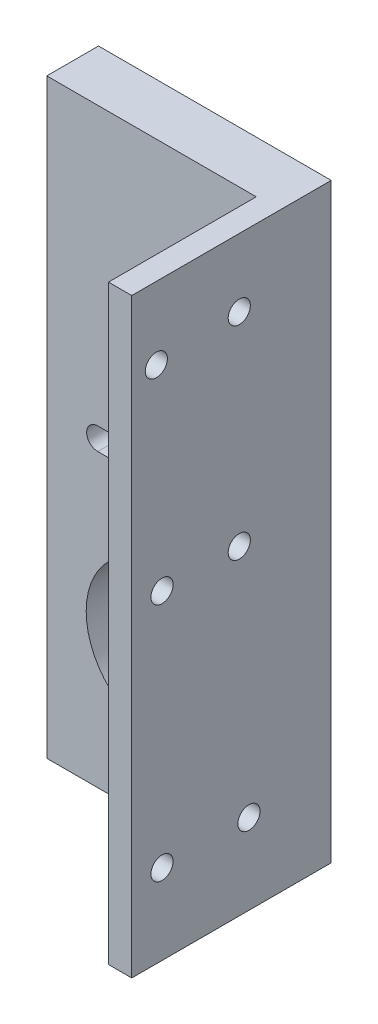
ISO-10303-21;
HEADER;
FILE_DESCRIPTION(('STEP AP214'),'2;1');
FILE_NAME('part.step','',(''),(''),'','','');
FILE_SCHEMA(('AUTOMOTIVE_DESIGN { 1 0 10303 214 1 1 1 1 }'));
ENDSEC;
DATA;
#1=APPLICATION_CONTEXT('core data for automotive mechanical design processes');
#2=APPLICATION_PROTOCOL_DEFINITION('international standard','automotive_design',2000,#1);
#3=PRODUCT_CONTEXT('',#1,'mechanical');
#4=PRODUCT('Part','Part','',(#3));
#5=PRODUCT_RELATED_PRODUCT_CATEGORY('part','',(#4));
#6=PRODUCT_DEFINITION_FORMATION('','',#4);
#7=PRODUCT_DEFINITION_CONTEXT('part definition',#1,'design');
#8=PRODUCT_DEFINITION('design','',#6,#7);
#9=PRODUCT_DEFINITION_SHAPE('','',#8);
#10=(LENGTH_UNIT() NAMED_UNIT(*) SI_UNIT(.MILLI.,.METRE.));
#11=(NAMED_UNIT(*) PLANE_ANGLE_UNIT() SI_UNIT($,.RADIAN.));
#12=(NAMED_UNIT(*) SI_UNIT($,.STERADIAN.) SOLID_ANGLE_UNIT());
#13=UNCERTAINTY_MEASURE_WITH_UNIT(LENGTH_MEASURE(1.E-05),#10,'distance_accuracy_value','');
#14=(GEOMETRIC_REPRESENTATION_CONTEXT(3) GLOBAL_UNCERTAINTY_ASSIGNED_CONTEXT((#13)) GLOBAL_UNIT_ASSIGNED_CONTEXT((#10,
#11,#12)) REPRESENTATION_CONTEXT('',''));
#15=CARTESIAN_POINT('',(0.,0.,0.));
#16=DIRECTION('',(0.,0.,1.));
#17=DIRECTION('',(1.,0.,0.));
#18=AXIS2_PLACEMENT_3D('',#15,#16,#17);
#19=CARTESIAN_POINT('',(12.602682203763,53.3770786942291,27.));
#20=DIRECTION('',(1.,0.,0.));
#21=DIRECTION('',(0.,0.,-1.));
#22=AXIS2_PLACEMENT_3D('',#19,#20,#21);
#23=PLANE('',#22);
#24=CARTESIAN_POINT('',(12.602682203763,43.5784982496159,23.673777790588));
#25=DIRECTION('',(-1.,0.,0.));
#26=DIRECTION('',(0.,0.,1.));
#27=AXIS2_PLACEMENT_3D('',#24,#25,#26);
#28=CIRCLE('',#27,1.49999999999999);
#29=CARTESIAN_POINT('',(12.602682203763,43.5784982496159,25.173777790588));
#30=VERTEX_POINT('',#29);
#31=EDGE_CURVE('E333',#30,#30,#28,.T.);
#32=ORIENTED_EDGE('',*,*,#31,.F.);
#33=EDGE_LOOP('',(#32));
#34=FACE_BOUND('',#33,.T.);
#35=CARTESIAN_POINT('',(12.602682203763,16.7045137847595,12.4447941729091));
#36=DIRECTION('',(-1.,0.,0.));
#37=DIRECTION('',(0.,0.,1.));
#38=AXIS2_PLACEMENT_3D('',#35,#36,#37);
#39=CIRCLE('',#38,1.49999999999999);
#40=CARTESIAN_POINT('',(12.602682203763,16.7045137847595,13.9447941729091));
#41=VERTEX_POINT('',#40);
#42=EDGE_CURVE('E309',#41,#41,#39,.T.);
#43=ORIENTED_EDGE('',*,*,#42,.F.);
#44=EDGE_LOOP('',(#43));
#45=FACE_BOUND('',#44,.T.);
#46=CARTESIAN_POINT('',(12.602682203763,16.7045137847595,22.9001078619948));
#47=DIRECTION('',(-1.,0.,0.));
#48=DIRECTION('',(0.,0.,1.));
#49=AXIS2_PLACEMENT_3D('',#46,#47,#48);
#50=CIRCLE('',#49,1.49999999999999);
#51=CARTESIAN_POINT('',(12.602682203763,16.7045137847595,24.4001078619948));
#52=VERTEX_POINT('',#51);
#53=EDGE_CURVE('E301',#52,#52,#50,.T.);
#54=ORIENTED_EDGE('',*,*,#53,.F.);
#55=EDGE_LOOP('',(#54));
#56=FACE_BOUND('',#55,.T.);
#57=DIRECTION('',(0.,1.,0.));
#58=VECTOR('',#57,1.);
#59=CARTESIAN_POINT('',(12.602682203763,0.,7.));
#60=LINE('',#59,#58);
#61=CARTESIAN_POINT('',(12.602682203763,-26.6229213057709,7.));
#62=VERTEX_POINT('',#61);
#63=CARTESIAN_POINT('',(12.602682203763,53.3770786942291,7.));
#64=VERTEX_POINT('',#63);
#65=EDGE_CURVE('E164',#62,#64,#60,.T.);
#66=ORIENTED_EDGE('',*,*,#65,.F.);
#67=DIRECTION('',(0.,0.,-1.));
#68=VECTOR('',#67,1.);
#69=CARTESIAN_POINT('',(12.602682203763,-26.6229213057709,27.));
#70=LINE('',#69,#68);
#71=CARTESIAN_POINT('',(12.602682203763,-26.6229213057709,27.));
#72=VERTEX_POINT('',#71);
#73=EDGE_CURVE('E59',#72,#62,#70,.T.);
#74=ORIENTED_EDGE('',*,*,#73,.F.);
#75=DIRECTION('',(0.,-1.,0.));
#76=VECTOR('',#75,1.);
#77=CARTESIAN_POINT('',(12.602682203763,53.3770786942291,27.));
#78=LINE('',#77,#76);
#79=CARTESIAN_POINT('',(12.602682203763,53.3770786942291,27.));
#80=VERTEX_POINT('',#79);
#81=EDGE_CURVE('E285',#80,#72,#78,.T.);
#82=ORIENTED_EDGE('',*,*,#81,.F.);
#83=DIRECTION('',(0.,0.,-1.));
#84=VECTOR('',#83,1.);
#85=CARTESIAN_POINT('',(12.602682203763,53.3770786942291,27.));
#86=LINE('',#85,#84);
#87=EDGE_CURVE('E275',#80,#64,#86,.T.);
#88=ORIENTED_EDGE('',*,*,#87,.T.);
#89=EDGE_LOOP('',(#66,#74,#82,#88));
#90=FACE_BOUND('',#89,.T.);
#91=CARTESIAN_POINT('',(12.602682203763,-15.739218974403,22.9001078619948));
#92=DIRECTION('',(-1.,0.,0.));
#93=DIRECTION('',(0.,0.,1.));
#94=AXIS2_PLACEMENT_3D('',#91,#92,#93);
#95=CIRCLE('',#94,1.49999999999999);
#96=CARTESIAN_POINT('',(12.602682203763,-15.739218974403,24.4001078619948));
#97=VERTEX_POINT('',#96);
#98=EDGE_CURVE('E317',#97,#97,#95,.T.);
#99=ORIENTED_EDGE('',*,*,#98,.F.);
#100=EDGE_LOOP('',(#99));
#101=FACE_BOUND('',#100,.T.);
#102=CARTESIAN_POINT('',(12.602682203763,-15.739218974403,11.1300727882533));
#103=DIRECTION('',(-1.,0.,0.));
#104=DIRECTION('',(0.,0.,1.));
#105=AXIS2_PLACEMENT_3D('',#102,#103,#104);
#106=CIRCLE('',#105,1.49999999999999);
#107=CARTESIAN_POINT('',(12.602682203763,-15.739218974403,12.6300727882533));
#108=VERTEX_POINT('',#107);
#109=EDGE_CURVE('E325',#108,#108,#106,.T.);
#110=ORIENTED_EDGE('',*,*,#109,.F.);
#111=EDGE_LOOP('',(#110));
#112=FACE_BOUND('',#111,.T.);
#113=CARTESIAN_POINT('',(12.602682203763,44.1925404225003,12.4447941729091));
#114=DIRECTION('',(-1.,0.,0.));
#115=DIRECTION('',(0.,0.,1.));
#116=AXIS2_PLACEMENT_3D('',#113,#114,#115);
#117=CIRCLE('',#116,1.49999999999999);
#118=CARTESIAN_POINT('',(12.602682203763,44.1925404225003,13.9447941729091));
#119=VERTEX_POINT('',#118);
#120=EDGE_CURVE('E341',#119,#119,#117,.T.);
#121=ORIENTED_EDGE('',*,*,#120,.F.);
#122=EDGE_LOOP('',(#121));
#123=FACE_BOUND('',#122,.T.);
#124=ADVANCED_FACE('F41',(#34,#45,#56,#90,#101,#112,#123),#23,.F.);
#125=CARTESIAN_POINT('',(0.,0.,7.));
#126=DIRECTION('',(0.,0.,1.));
#127=DIRECTION('',(1.,0.,0.));
#128=AXIS2_PLACEMENT_3D('',#125,#126,#127);
#129=PLANE('',#128);
#130=CARTESIAN_POINT('',(-2.70616862252382E-13,-20.2083333333333,7.));
#131=DIRECTION('',(0.,0.,1.));
#132=DIRECTION('',(1.,0.,0.));
#133=AXIS2_PLACEMENT_3D('',#130,#131,#132);
#134=CIRCLE('',#133,1.56);
#135=CARTESIAN_POINT('',(1.55999999999973,-20.2083333333333,7.));
#136=VERTEX_POINT('',#135);
#137=EDGE_CURVE('E135',#136,#136,#134,.T.);
#138=ORIENTED_EDGE('',*,*,#137,.F.);
#139=EDGE_LOOP('',(#138));
#140=FACE_BOUND('',#139,.T.);
#141=CARTESIAN_POINT('',(8.85,14.2916666666667,7.));
#142=DIRECTION('',(0.,0.,1.));
#143=DIRECTION('',(1.,0.,0.));
#144=AXIS2_PLACEMENT_3D('',#141,#142,#143);
#145=CIRCLE('',#144,1.5);
#146=CARTESIAN_POINT('',(8.85,12.7916666666667,7.));
#147=VERTEX_POINT('',#146);
#148=CARTESIAN_POINT('',(8.85,15.7916666666667,7.));
#149=VERTEX_POINT('',#148);
#150=EDGE_CURVE('E130',#147,#149,#145,.T.);
#151=ORIENTED_EDGE('',*,*,#150,.F.);
#152=DIRECTION('',(-1.,0.,0.));
#153=VECTOR('',#152,1.);
#154=CARTESIAN_POINT('',(0.,12.7916666666667,7.));
#155=LINE('',#154,#153);
#156=CARTESIAN_POINT('',(-8.85,12.7916666666667,7.));
#157=VERTEX_POINT('',#156);
#158=EDGE_CURVE('E134',#147,#157,#155,.T.);
#159=ORIENTED_EDGE('',*,*,#158,.T.);
#160=CARTESIAN_POINT('',(-8.85,14.2916666666667,7.));
#161=DIRECTION('',(0.,0.,1.));
#162=DIRECTION('',(1.,0.,0.));
#163=AXIS2_PLACEMENT_3D('',#160,#161,#162);
#164=CIRCLE('',#163,1.5);
#165=CARTESIAN_POINT('',(-8.85,15.7916666666667,7.));
#166=VERTEX_POINT('',#165);
#167=EDGE_CURVE('E141',#166,#157,#164,.T.);
#168=ORIENTED_EDGE('',*,*,#167,.F.);
#169=DIRECTION('',(-1.,0.,0.));
#170=VECTOR('',#169,1.);
#171=CARTESIAN_POINT('',(0.,15.7916666666667,7.));
#172=LINE('',#171,#170);
#173=EDGE_CURVE('E121',#149,#166,#172,.T.);
#174=ORIENTED_EDGE('',*,*,#173,.F.);
#175=EDGE_LOOP('',(#151,#159,#168,#174));
#176=FACE_BOUND('',#175,.T.);
#177=CARTESIAN_POINT('',(0.,-6.70833333333333,7.));
#178=DIRECTION('',(0.,0.,1.));
#179=DIRECTION('',(1.,0.,0.));
#180=AXIS2_PLACEMENT_3D('',#177,#178,#179);
#181=CIRCLE('',#180,10.4175243347668);
#182=CARTESIAN_POINT('',(10.4175243347668,-6.70833333333333,7.));
#183=VERTEX_POINT('',#182);
#184=EDGE_CURVE('E143',#183,#183,#181,.T.);
#185=ORIENTED_EDGE('',*,*,#184,.F.);
#186=EDGE_LOOP('',(#185));
#187=FACE_BOUND('',#186,.T.);
#188=DIRECTION('',(-1.,0.,0.));
#189=VECTOR('',#188,1.);
#190=CARTESIAN_POINT('',(0.,-26.6229213057709,7.));
#191=LINE('',#190,#189);
#192=CARTESIAN_POINT('',(-15.7504319540044,-26.6229213057709,7.));
#193=VERTEX_POINT('',#192);
#194=EDGE_CURVE('E65',#62,#193,#191,.T.);
#195=ORIENTED_EDGE('',*,*,#194,.F.);
#196=ORIENTED_EDGE('',*,*,#65,.T.);
#197=DIRECTION('',(-1.,0.,0.));
#198=VECTOR('',#197,1.);
#199=CARTESIAN_POINT('',(0.,53.3770786942291,7.));
#200=LINE('',#199,#198);
#201=CARTESIAN_POINT('',(-15.7504319540044,53.3770786942291,7.));
#202=VERTEX_POINT('',#201);
#203=EDGE_CURVE('E154',#64,#202,#200,.T.);
#204=ORIENTED_EDGE('',*,*,#203,.T.);
#205=DIRECTION('',(0.,-1.,0.));
#206=VECTOR('',#205,1.);
#207=CARTESIAN_POINT('',(-15.7504319540044,0.,7.));
#208=LINE('',#207,#206);
#209=EDGE_CURVE('E127',#202,#193,#208,.T.);
#210=ORIENTED_EDGE('',*,*,#209,.T.);
#211=EDGE_LOOP('',(#195,#196,#204,#210));
#212=FACE_BOUND('',#211,.T.);
#213=ADVANCED_FACE('F138',(#140,#176,#187,#212),#129,.T.);
#214=CARTESIAN_POINT('',(0.,-26.6229213057709,7.));
#215=DIRECTION('',(0.,-1.,0.));
#216=DIRECTION('',(0.,0.,-1.));
#217=AXIS2_PLACEMENT_3D('',#214,#215,#216);
#218=PLANE('',#217);
#219=ORIENTED_EDGE('',*,*,#73,.T.);
#220=ORIENTED_EDGE('',*,*,#194,.T.);
#221=DIRECTION('',(0.,0.,-1.));
#222=VECTOR('',#221,1.);
#223=CARTESIAN_POINT('',(-15.7504319540044,-26.6229213057709,7.));
#224=LINE('',#223,#222);
#225=CARTESIAN_POINT('',(-15.7504319540044,-26.6229213057709,0.));
#226=VERTEX_POINT('',#225);
#227=EDGE_CURVE('E193',#193,#226,#224,.T.);
#228=ORIENTED_EDGE('',*,*,#227,.T.);
#229=DIRECTION('',(-1.,0.,0.));
#230=VECTOR('',#229,1.);
#231=CARTESIAN_POINT('',(0.,-26.6229213057709,0.));
#232=LINE('',#231,#230);
#233=CARTESIAN_POINT('',(15.7504319540038,-26.6229213057709,0.));
#234=VERTEX_POINT('',#233);
#235=EDGE_CURVE('E99',#234,#226,#232,.T.);
#236=ORIENTED_EDGE('',*,*,#235,.F.);
#237=DIRECTION('',(0.,0.,-1.));
#238=VECTOR('',#237,1.);
#239=CARTESIAN_POINT('',(15.7504319540038,-26.6229213057709,7.));
#240=LINE('',#239,#238);
#241=CARTESIAN_POINT('',(15.7504319540038,-26.6229213057709,27.));
#242=VERTEX_POINT('',#241);
#243=EDGE_CURVE('E11',#242,#234,#240,.T.);
#244=ORIENTED_EDGE('',*,*,#243,.F.);
#245=DIRECTION('',(1.,0.,0.));
#246=VECTOR('',#245,1.);
#247=CARTESIAN_POINT('',(12.602682203763,-26.6229213057709,27.));
#248=LINE('',#247,#246);
#249=EDGE_CURVE('E281',#72,#242,#248,.T.);
#250=ORIENTED_EDGE('',*,*,#249,.F.);
#251=EDGE_LOOP('',(#219,#220,#228,#236,#244,#250));
#252=FACE_BOUND('',#251,.T.);
#253=ADVANCED_FACE('F233',(#252),#218,.T.);
#254=CARTESIAN_POINT('',(15.7504319540038,0.,7.));
#255=DIRECTION('',(1.,0.,0.));
#256=DIRECTION('',(0.,1.,0.));
#257=AXIS2_PLACEMENT_3D('',#254,#255,#256);
#258=PLANE('',#257);
#259=CARTESIAN_POINT('',(15.7504319540038,44.1925404225003,12.4447941729091));
#260=DIRECTION('',(1.,0.,0.));
#261=DIRECTION('',(0.,1.,0.));
#262=AXIS2_PLACEMENT_3D('',#259,#260,#261);
#263=CIRCLE('',#262,1.49999999999999);
#264=CARTESIAN_POINT('',(15.7504319540038,45.6925404225003,12.4447941729091));
#265=VERTEX_POINT('',#264);
#266=EDGE_CURVE('E337',#265,#265,#263,.T.);
#267=ORIENTED_EDGE('',*,*,#266,.F.);
#268=EDGE_LOOP('',(#267));
#269=FACE_BOUND('',#268,.T.);
#270=CARTESIAN_POINT('',(15.7504319540038,43.5784982496159,23.673777790588));
#271=DIRECTION('',(1.,0.,0.));
#272=DIRECTION('',(0.,1.,0.));
#273=AXIS2_PLACEMENT_3D('',#270,#271,#272);
#274=CIRCLE('',#273,1.49999999999999);
#275=CARTESIAN_POINT('',(15.7504319540038,45.0784982496159,23.673777790588));
#276=VERTEX_POINT('',#275);
#277=EDGE_CURVE('E329',#276,#276,#274,.T.);
#278=ORIENTED_EDGE('',*,*,#277,.F.);
#279=EDGE_LOOP('',(#278));
#280=FACE_BOUND('',#279,.T.);
#281=CARTESIAN_POINT('',(15.7504319540038,-15.739218974403,11.1300727882533));
#282=DIRECTION('',(1.,0.,0.));
#283=DIRECTION('',(0.,1.,0.));
#284=AXIS2_PLACEMENT_3D('',#281,#282,#283);
#285=CIRCLE('',#284,1.49999999999999);
#286=CARTESIAN_POINT('',(15.7504319540038,-14.239218974403,11.1300727882533));
#287=VERTEX_POINT('',#286);
#288=EDGE_CURVE('E321',#287,#287,#285,.T.);
#289=ORIENTED_EDGE('',*,*,#288,.F.);
#290=EDGE_LOOP('',(#289));
#291=FACE_BOUND('',#290,.T.);
#292=CARTESIAN_POINT('',(15.7504319540038,-15.739218974403,22.9001078619948));
#293=DIRECTION('',(1.,0.,0.));
#294=DIRECTION('',(0.,1.,0.));
#295=AXIS2_PLACEMENT_3D('',#292,#293,#294);
#296=CIRCLE('',#295,1.49999999999999);
#297=CARTESIAN_POINT('',(15.7504319540038,-14.239218974403,22.9001078619948));
#298=VERTEX_POINT('',#297);
#299=EDGE_CURVE('E313',#298,#298,#296,.T.);
#300=ORIENTED_EDGE('',*,*,#299,.F.);
#301=EDGE_LOOP('',(#300));
#302=FACE_BOUND('',#301,.T.);
#303=CARTESIAN_POINT('',(15.7504319540038,16.7045137847595,12.4447941729091));
#304=DIRECTION('',(1.,0.,0.));
#305=DIRECTION('',(0.,1.,0.));
#306=AXIS2_PLACEMENT_3D('',#303,#304,#305);
#307=CIRCLE('',#306,1.49999999999999);
#308=CARTESIAN_POINT('',(15.7504319540038,18.2045137847594,12.4447941729091));
#309=VERTEX_POINT('',#308);
#310=EDGE_CURVE('E305',#309,#309,#307,.T.);
#311=ORIENTED_EDGE('',*,*,#310,.F.);
#312=EDGE_LOOP('',(#311));
#313=FACE_BOUND('',#312,.T.);
#314=CARTESIAN_POINT('',(15.7504319540038,16.7045137847595,22.9001078619948));
#315=DIRECTION('',(1.,0.,0.));
#316=DIRECTION('',(0.,1.,0.));
#317=AXIS2_PLACEMENT_3D('',#314,#315,#316);
#318=CIRCLE('',#317,1.49999999999999);
#319=CARTESIAN_POINT('',(15.7504319540038,18.2045137847594,22.9001078619948));
#320=VERTEX_POINT('',#319);
#321=EDGE_CURVE('E297',#320,#320,#318,.T.);
#322=ORIENTED_EDGE('',*,*,#321,.F.);
#323=EDGE_LOOP('',(#322));
#324=FACE_BOUND('',#323,.T.);
#325=DIRECTION('',(0.,-1.,0.));
#326=VECTOR('',#325,1.);
#327=CARTESIAN_POINT('',(15.7504319540038,0.,0.));
#328=LINE('',#327,#326);
#329=CARTESIAN_POINT('',(15.7504319540038,53.3770786942291,0.));
#330=VERTEX_POINT('',#329);
#331=EDGE_CURVE('E183',#330,#234,#328,.T.);
#332=ORIENTED_EDGE('',*,*,#331,.F.);
#333=DIRECTION('',(0.,0.,-1.));
#334=VECTOR('',#333,1.);
#335=CARTESIAN_POINT('',(15.7504319540038,53.3770786942291,7.));
#336=LINE('',#335,#334);
#337=CARTESIAN_POINT('',(15.7504319540038,53.3770786942291,27.));
#338=VERTEX_POINT('',#337);
#339=EDGE_CURVE('E51',#338,#330,#336,.T.);
#340=ORIENTED_EDGE('',*,*,#339,.F.);
#341=DIRECTION('',(0.,1.,0.));
#342=VECTOR('',#341,1.);
#343=CARTESIAN_POINT('',(15.7504319540038,-26.6229213057709,27.));
#344=LINE('',#343,#342);
#345=EDGE_CURVE('E293',#242,#338,#344,.T.);
#346=ORIENTED_EDGE('',*,*,#345,.F.);
#347=ORIENTED_EDGE('',*,*,#243,.T.);
#348=EDGE_LOOP('',(#332,#340,#346,#347));
#349=FACE_BOUND('',#348,.T.);
#350=ADVANCED_FACE('F251',(#269,#280,#291,#302,#313,#324,#349),#258,.T.);
#351=CARTESIAN_POINT('',(0.,53.3770786942291,7.));
#352=DIRECTION('',(0.,-1.,0.));
#353=DIRECTION('',(1.,0.,0.));
#354=AXIS2_PLACEMENT_3D('',#351,#352,#353);
#355=PLANE('',#354);
#356=DIRECTION('',(-1.,0.,0.));
#357=VECTOR('',#356,1.);
#358=CARTESIAN_POINT('',(0.,53.3770786942291,0.));
#359=LINE('',#358,#357);
#360=CARTESIAN_POINT('',(-15.7504319540044,53.3770786942291,0.));
#361=VERTEX_POINT('',#360);
#362=EDGE_CURVE('E186',#330,#361,#359,.T.);
#363=ORIENTED_EDGE('',*,*,#362,.T.);
#364=DIRECTION('',(0.,0.,-1.));
#365=VECTOR('',#364,1.);
#366=CARTESIAN_POINT('',(-15.7504319540044,53.3770786942291,7.));
#367=LINE('',#366,#365);
#368=EDGE_CURVE('E196',#202,#361,#367,.T.);
#369=ORIENTED_EDGE('',*,*,#368,.F.);
#370=ORIENTED_EDGE('',*,*,#203,.F.);
#371=ORIENTED_EDGE('',*,*,#87,.F.);
#372=DIRECTION('',(-1.,0.,0.));
#373=VECTOR('',#372,1.);
#374=CARTESIAN_POINT('',(15.7504319540038,53.3770786942291,27.));
#375=LINE('',#374,#373);
#376=EDGE_CURVE('E289',#338,#80,#375,.T.);
#377=ORIENTED_EDGE('',*,*,#376,.F.);
#378=ORIENTED_EDGE('',*,*,#339,.T.);
#379=EDGE_LOOP('',(#363,#369,#370,#371,#377,#378));
#380=FACE_BOUND('',#379,.T.);
#381=ADVANCED_FACE('F248',(#380),#355,.F.);
#382=CARTESIAN_POINT('',(8.85,14.2916666666667,7.));
#383=DIRECTION('',(0.,0.,-1.));
#384=DIRECTION('',(-1.,0.,0.));
#385=AXIS2_PLACEMENT_3D('',#382,#383,#384);
#386=CYLINDRICAL_SURFACE('',#385,1.5);
#387=CARTESIAN_POINT('',(8.85,14.2916666666667,0.));
#388=DIRECTION('',(0.,0.,1.));
#389=DIRECTION('',(1.,0.,0.));
#390=AXIS2_PLACEMENT_3D('',#387,#388,#389);
#391=CIRCLE('',#390,1.5);
#392=CARTESIAN_POINT('',(8.85,12.7916666666667,0.));
#393=VERTEX_POINT('',#392);
#394=CARTESIAN_POINT('',(8.85,15.7916666666667,0.));
#395=VERTEX_POINT('',#394);
#396=EDGE_CURVE('E163',#393,#395,#391,.T.);
#397=ORIENTED_EDGE('',*,*,#396,.F.);
#398=DIRECTION('',(0.,0.,-1.));
#399=VECTOR('',#398,1.);
#400=CARTESIAN_POINT('',(8.85,12.7916666666667,7.));
#401=LINE('',#400,#399);
#402=EDGE_CURVE('E45',#147,#393,#401,.T.);
#403=ORIENTED_EDGE('',*,*,#402,.F.);
#404=ORIENTED_EDGE('',*,*,#150,.T.);
#405=DIRECTION('',(0.,0.,-1.));
#406=VECTOR('',#405,1.);
#407=CARTESIAN_POINT('',(8.85,15.7916666666667,7.));
#408=LINE('',#407,#406);
#409=EDGE_CURVE('E118',#149,#395,#408,.T.);
#410=ORIENTED_EDGE('',*,*,#409,.T.);
#411=EDGE_LOOP('',(#397,#403,#404,#410));
#412=FACE_BOUND('',#411,.T.);
#413=ADVANCED_FACE('F131',(#412),#386,.F.);
#414=CARTESIAN_POINT('',(0.,12.7916666666667,7.));
#415=DIRECTION('',(0.,-1.,0.));
#416=DIRECTION('',(1.,0.,0.));
#417=AXIS2_PLACEMENT_3D('',#414,#415,#416);
#418=PLANE('',#417);
#419=DIRECTION('',(-1.,0.,0.));
#420=VECTOR('',#419,1.);
#421=CARTESIAN_POINT('',(0.,12.7916666666667,0.));
#422=LINE('',#421,#420);
#423=CARTESIAN_POINT('',(-8.85,12.7916666666667,0.));
#424=VERTEX_POINT('',#423);
#425=EDGE_CURVE('E167',#393,#424,#422,.T.);
#426=ORIENTED_EDGE('',*,*,#425,.T.);
#427=DIRECTION('',(0.,0.,-1.));
#428=VECTOR('',#427,1.);
#429=CARTESIAN_POINT('',(-8.85,12.7916666666667,7.));
#430=LINE('',#429,#428);
#431=EDGE_CURVE('E203',#157,#424,#430,.T.);
#432=ORIENTED_EDGE('',*,*,#431,.F.);
#433=ORIENTED_EDGE('',*,*,#158,.F.);
#434=ORIENTED_EDGE('',*,*,#402,.T.);
#435=EDGE_LOOP('',(#426,#432,#433,#434));
#436=FACE_BOUND('',#435,.T.);
#437=ADVANCED_FACE('F211',(#436),#418,.F.);
#438=CARTESIAN_POINT('',(-8.85,14.2916666666667,7.));
#439=DIRECTION('',(0.,0.,-1.));
#440=DIRECTION('',(-1.,0.,0.));
#441=AXIS2_PLACEMENT_3D('',#438,#439,#440);
#442=CYLINDRICAL_SURFACE('',#441,1.5);
#443=CARTESIAN_POINT('',(-8.85,14.2916666666667,0.));
#444=DIRECTION('',(0.,0.,1.));
#445=DIRECTION('',(1.,0.,0.));
#446=AXIS2_PLACEMENT_3D('',#443,#444,#445);
#447=CIRCLE('',#446,1.5);
#448=CARTESIAN_POINT('',(-8.85,15.7916666666667,0.));
#449=VERTEX_POINT('',#448);
#450=EDGE_CURVE('E171',#449,#424,#447,.T.);
#451=ORIENTED_EDGE('',*,*,#450,.F.);
#452=DIRECTION('',(0.,0.,-1.));
#453=VECTOR('',#452,1.);
#454=CARTESIAN_POINT('',(-8.85,15.7916666666667,7.));
#455=LINE('',#454,#453);
#456=EDGE_CURVE('E126',#166,#449,#455,.T.);
#457=ORIENTED_EDGE('',*,*,#456,.F.);
#458=ORIENTED_EDGE('',*,*,#167,.T.);
#459=ORIENTED_EDGE('',*,*,#431,.T.);
#460=EDGE_LOOP('',(#451,#457,#458,#459));
#461=FACE_BOUND('',#460,.T.);
#462=ADVANCED_FACE('F215',(#461),#442,.F.);
#463=CARTESIAN_POINT('',(0.,-6.70833333333333,7.));
#464=DIRECTION('',(0.,0.,-1.));
#465=DIRECTION('',(-1.,0.,0.));
#466=AXIS2_PLACEMENT_3D('',#463,#464,#465);
#467=CYLINDRICAL_SURFACE('',#466,10.4175243347668);
#468=ORIENTED_EDGE('',*,*,#184,.T.);
#469=EDGE_LOOP('',(#468));
#470=FACE_BOUND('',#469,.T.);
#471=CARTESIAN_POINT('',(0.,-6.70833333333333,0.));
#472=DIRECTION('',(0.,0.,1.));
#473=DIRECTION('',(1.,0.,0.));
#474=AXIS2_PLACEMENT_3D('',#471,#472,#473);
#475=CIRCLE('',#474,10.4175243347668);
#476=CARTESIAN_POINT('',(10.4175243347668,-6.70833333333333,0.));
#477=VERTEX_POINT('',#476);
#478=EDGE_CURVE('E177',#477,#477,#475,.T.);
#479=ORIENTED_EDGE('',*,*,#478,.F.);
#480=EDGE_LOOP('',(#479));
#481=FACE_BOUND('',#480,.T.);
#482=ADVANCED_FACE('F217',(#470,#481),#467,.F.);
#483=CARTESIAN_POINT('',(0.,15.7916666666667,7.));
#484=DIRECTION('',(0.,-1.,0.));
#485=DIRECTION('',(1.,0.,0.));
#486=AXIS2_PLACEMENT_3D('',#483,#484,#485);
#487=PLANE('',#486);
#488=DIRECTION('',(-1.,0.,0.));
#489=VECTOR('',#488,1.);
#490=CARTESIAN_POINT('',(0.,15.7916666666667,0.));
#491=LINE('',#490,#489);
#492=EDGE_CURVE('E123',#395,#449,#491,.T.);
#493=ORIENTED_EDGE('',*,*,#492,.F.);
#494=ORIENTED_EDGE('',*,*,#409,.F.);
#495=ORIENTED_EDGE('',*,*,#173,.T.);
#496=ORIENTED_EDGE('',*,*,#456,.T.);
#497=EDGE_LOOP('',(#493,#494,#495,#496));
#498=FACE_BOUND('',#497,.T.);
#499=ADVANCED_FACE('F119',(#498),#487,.T.);
#500=CARTESIAN_POINT('',(-2.70616862252382E-13,-20.2083333333333,7.));
#501=DIRECTION('',(0.,0.,-1.));
#502=DIRECTION('',(-1.,0.,0.));
#503=AXIS2_PLACEMENT_3D('',#500,#501,#502);
#504=CYLINDRICAL_SURFACE('',#503,1.56);
#505=ORIENTED_EDGE('',*,*,#137,.T.);
#506=EDGE_LOOP('',(#505));
#507=FACE_BOUND('',#506,.T.);
#508=CARTESIAN_POINT('',(-2.70616862252382E-13,-20.2083333333333,0.));
#509=DIRECTION('',(0.,0.,1.));
#510=DIRECTION('',(1.,0.,0.));
#511=AXIS2_PLACEMENT_3D('',#508,#509,#510);
#512=CIRCLE('',#511,1.56);
#513=CARTESIAN_POINT('',(1.55999999999973,-20.2083333333333,0.));
#514=VERTEX_POINT('',#513);
#515=EDGE_CURVE('E159',#514,#514,#512,.T.);
#516=ORIENTED_EDGE('',*,*,#515,.F.);
#517=EDGE_LOOP('',(#516));
#518=FACE_BOUND('',#517,.T.);
#519=ADVANCED_FACE('F43',(#507,#518),#504,.F.);
#520=CARTESIAN_POINT('',(-15.7504319540044,0.,7.));
#521=DIRECTION('',(1.,0.,0.));
#522=DIRECTION('',(0.,0.,-1.));
#523=AXIS2_PLACEMENT_3D('',#520,#521,#522);
#524=PLANE('',#523);
#525=DIRECTION('',(0.,-1.,0.));
#526=VECTOR('',#525,1.);
#527=CARTESIAN_POINT('',(-15.7504319540044,0.,0.));
#528=LINE('',#527,#526);
#529=EDGE_CURVE('E189',#361,#226,#528,.T.);
#530=ORIENTED_EDGE('',*,*,#529,.T.);
#531=ORIENTED_EDGE('',*,*,#227,.F.);
#532=ORIENTED_EDGE('',*,*,#209,.F.);
#533=ORIENTED_EDGE('',*,*,#368,.T.);
#534=EDGE_LOOP('',(#530,#531,#532,#533));
#535=FACE_BOUND('',#534,.T.);
#536=ADVANCED_FACE('F244',(#535),#524,.F.);
#537=CARTESIAN_POINT('',(0.,0.,0.));
#538=DIRECTION('',(0.,0.,1.));
#539=DIRECTION('',(1.,0.,0.));
#540=AXIS2_PLACEMENT_3D('',#537,#538,#539);
#541=PLANE('',#540);
#542=ORIENTED_EDGE('',*,*,#235,.T.);
#543=ORIENTED_EDGE('',*,*,#529,.F.);
#544=ORIENTED_EDGE('',*,*,#362,.F.);
#545=ORIENTED_EDGE('',*,*,#331,.T.);
#546=EDGE_LOOP('',(#542,#543,#544,#545));
#547=FACE_BOUND('',#546,.T.);
#548=ORIENTED_EDGE('',*,*,#478,.T.);
#549=EDGE_LOOP('',(#548));
#550=FACE_BOUND('',#549,.T.);
#551=ORIENTED_EDGE('',*,*,#396,.T.);
#552=ORIENTED_EDGE('',*,*,#492,.T.);
#553=ORIENTED_EDGE('',*,*,#450,.T.);
#554=ORIENTED_EDGE('',*,*,#425,.F.);
#555=EDGE_LOOP('',(#551,#552,#553,#554));
#556=FACE_BOUND('',#555,.T.);
#557=ORIENTED_EDGE('',*,*,#515,.T.);
#558=EDGE_LOOP('',(#557));
#559=FACE_BOUND('',#558,.T.);
#560=ADVANCED_FACE('F213',(#547,#550,#556,#559),#541,.F.);
#561=CARTESIAN_POINT('',(0.,0.,27.));
#562=DIRECTION('',(0.,0.,1.));
#563=DIRECTION('',(1.,0.,0.));
#564=AXIS2_PLACEMENT_3D('',#561,#562,#563);
#565=PLANE('',#564);
#566=ORIENTED_EDGE('',*,*,#345,.T.);
#567=ORIENTED_EDGE('',*,*,#376,.T.);
#568=ORIENTED_EDGE('',*,*,#81,.T.);
#569=ORIENTED_EDGE('',*,*,#249,.T.);
#570=EDGE_LOOP('',(#566,#567,#568,#569));
#571=FACE_BOUND('',#570,.T.);
#572=ADVANCED_FACE('F239',(#571),#565,.T.);
#573=CARTESIAN_POINT('',(12.602682203763,16.7045137847595,22.9001078619948));
#574=DIRECTION('',(-1.,0.,0.));
#575=DIRECTION('',(0.,0.,1.));
#576=AXIS2_PLACEMENT_3D('',#573,#574,#575);
#577=CYLINDRICAL_SURFACE('',#576,1.49999999999999);
#578=ORIENTED_EDGE('',*,*,#53,.T.);
#579=EDGE_LOOP('',(#578));
#580=FACE_BOUND('',#579,.T.);
#581=ORIENTED_EDGE('',*,*,#321,.T.);
#582=EDGE_LOOP('',(#581));
#583=FACE_BOUND('',#582,.T.);
#584=ADVANCED_FACE('F408',(#580,#583),#577,.F.);
#585=CARTESIAN_POINT('',(12.602682203763,16.7045137847595,12.4447941729091));
#586=DIRECTION('',(-1.,0.,0.));
#587=DIRECTION('',(0.,0.,1.));
#588=AXIS2_PLACEMENT_3D('',#585,#586,#587);
#589=CYLINDRICAL_SURFACE('',#588,1.49999999999999);
#590=ORIENTED_EDGE('',*,*,#42,.T.);
#591=EDGE_LOOP('',(#590));
#592=FACE_BOUND('',#591,.T.);
#593=ORIENTED_EDGE('',*,*,#310,.T.);
#594=EDGE_LOOP('',(#593));
#595=FACE_BOUND('',#594,.T.);
#596=ADVANCED_FACE('F403',(#592,#595),#589,.F.);
#597=CARTESIAN_POINT('',(12.602682203763,-15.739218974403,22.9001078619948));
#598=DIRECTION('',(-1.,0.,0.));
#599=DIRECTION('',(0.,0.,1.));
#600=AXIS2_PLACEMENT_3D('',#597,#598,#599);
#601=CYLINDRICAL_SURFACE('',#600,1.49999999999999);
#602=ORIENTED_EDGE('',*,*,#98,.T.);
#603=EDGE_LOOP('',(#602));
#604=FACE_BOUND('',#603,.T.);
#605=ORIENTED_EDGE('',*,*,#299,.T.);
#606=EDGE_LOOP('',(#605));
#607=FACE_BOUND('',#606,.T.);
#608=ADVANCED_FACE('F395',(#604,#607),#601,.F.);
#609=CARTESIAN_POINT('',(12.602682203763,-15.739218974403,11.1300727882533));
#610=DIRECTION('',(-1.,0.,0.));
#611=DIRECTION('',(0.,0.,1.));
#612=AXIS2_PLACEMENT_3D('',#609,#610,#611);
#613=CYLINDRICAL_SURFACE('',#612,1.49999999999999);
#614=ORIENTED_EDGE('',*,*,#109,.T.);
#615=EDGE_LOOP('',(#614));
#616=FACE_BOUND('',#615,.T.);
#617=ORIENTED_EDGE('',*,*,#288,.T.);
#618=EDGE_LOOP('',(#617));
#619=FACE_BOUND('',#618,.T.);
#620=ADVANCED_FACE('F392',(#616,#619),#613,.F.);
#621=CARTESIAN_POINT('',(12.602682203763,43.5784982496159,23.673777790588));
#622=DIRECTION('',(-1.,0.,0.));
#623=DIRECTION('',(0.,0.,1.));
#624=AXIS2_PLACEMENT_3D('',#621,#622,#623);
#625=CYLINDRICAL_SURFACE('',#624,1.49999999999999);
#626=ORIENTED_EDGE('',*,*,#31,.T.);
#627=EDGE_LOOP('',(#626));
#628=FACE_BOUND('',#627,.T.);
#629=ORIENTED_EDGE('',*,*,#277,.T.);
#630=EDGE_LOOP('',(#629));
#631=FACE_BOUND('',#630,.T.);
#632=ADVANCED_FACE('F350',(#628,#631),#625,.F.);
#633=CARTESIAN_POINT('',(12.602682203763,44.1925404225003,12.4447941729091));
#634=DIRECTION('',(-1.,0.,0.));
#635=DIRECTION('',(0.,0.,1.));
#636=AXIS2_PLACEMENT_3D('',#633,#634,#635);
#637=CYLINDRICAL_SURFACE('',#636,1.49999999999999);
#638=ORIENTED_EDGE('',*,*,#120,.T.);
#639=EDGE_LOOP('',(#638));
#640=FACE_BOUND('',#639,.T.);
#641=ORIENTED_EDGE('',*,*,#266,.T.);
#642=EDGE_LOOP('',(#641));
#643=FACE_BOUND('',#642,.T.);
#644=ADVANCED_FACE('F346',(#640,#643),#637,.F.);
#645=CLOSED_SHELL('',(#124,#213,#253,#350,#381,#413,#437,#462,#482,#499,#519,#536,#560,#572,
#584,#596,#608,#620,#632,#644));
#646=MANIFOLD_SOLID_BREP('B2',#645);
#647=ADVANCED_BREP_SHAPE_REPRESENTATION('',(#18,#646),#14);
#648=SHAPE_DEFINITION_REPRESENTATION(#9,#647);
ENDSEC;
END-ISO-10303-21;
